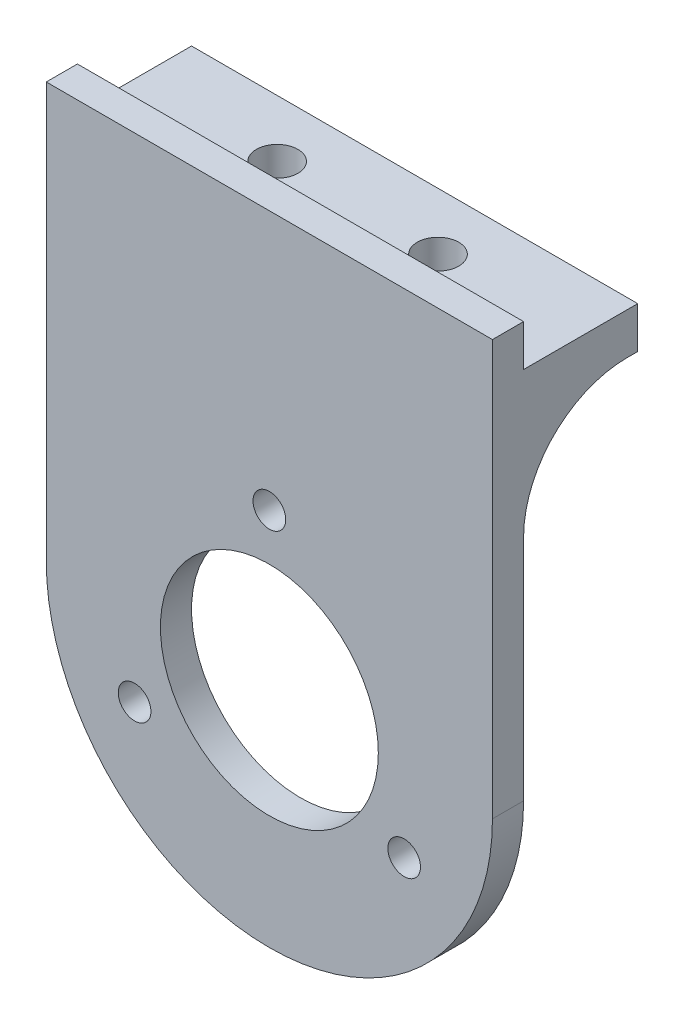
ISO-10303-21;
HEADER;
FILE_DESCRIPTION(('STEP AP214'),'2;1');
FILE_NAME('part.step','',(''),(''),'','','');
FILE_SCHEMA(('AUTOMOTIVE_DESIGN { 1 0 10303 214 1 1 1 1 }'));
ENDSEC;
DATA;
#1=APPLICATION_CONTEXT('core data for automotive mechanical design processes');
#2=APPLICATION_PROTOCOL_DEFINITION('international standard','automotive_design',2000,#1);
#3=PRODUCT_CONTEXT('',#1,'mechanical');
#4=PRODUCT('Part','Part','',(#3));
#5=PRODUCT_RELATED_PRODUCT_CATEGORY('part','',(#4));
#6=PRODUCT_DEFINITION_FORMATION('','',#4);
#7=PRODUCT_DEFINITION_CONTEXT('part definition',#1,'design');
#8=PRODUCT_DEFINITION('design','',#6,#7);
#9=PRODUCT_DEFINITION_SHAPE('','',#8);
#10=(LENGTH_UNIT() NAMED_UNIT(*) SI_UNIT(.MILLI.,.METRE.));
#11=(NAMED_UNIT(*) PLANE_ANGLE_UNIT() SI_UNIT($,.RADIAN.));
#12=(NAMED_UNIT(*) SI_UNIT($,.STERADIAN.) SOLID_ANGLE_UNIT());
#13=UNCERTAINTY_MEASURE_WITH_UNIT(LENGTH_MEASURE(1.E-05),#10,'distance_accuracy_value','');
#14=(GEOMETRIC_REPRESENTATION_CONTEXT(3) GLOBAL_UNCERTAINTY_ASSIGNED_CONTEXT((#13)) GLOBAL_UNIT_ASSIGNED_CONTEXT((#10,
#11,#12)) REPRESENTATION_CONTEXT('',''));
#15=CARTESIAN_POINT('',(0.,0.,0.));
#16=DIRECTION('',(0.,0.,1.));
#17=DIRECTION('',(1.,0.,0.));
#18=AXIS2_PLACEMENT_3D('',#15,#16,#17);
#19=CARTESIAN_POINT('',(-21.51,29.,78.7));
#20=DIRECTION('',(0.,1.,0.));
#21=DIRECTION('',(0.,0.,1.));
#22=AXIS2_PLACEMENT_3D('',#19,#20,#21);
#23=PLANE('',#22);
#24=CARTESIAN_POINT('',(-7.75,29.,84.2));
#25=DIRECTION('',(0.,1.,0.));
#26=DIRECTION('',(0.,0.,1.));
#27=AXIS2_PLACEMENT_3D('',#24,#25,#26);
#28=CIRCLE('',#27,2.);
#29=CARTESIAN_POINT('',(-7.75,29.,86.2));
#30=VERTEX_POINT('',#29);
#31=EDGE_CURVE('E44',#30,#30,#28,.F.);
#32=ORIENTED_EDGE('',*,*,#31,.T.);
#33=EDGE_LOOP('',(#32));
#34=FACE_BOUND('',#33,.T.);
#35=CARTESIAN_POINT('',(7.75,29.,84.2));
#36=DIRECTION('',(0.,1.,0.));
#37=DIRECTION('',(0.,0.,1.));
#38=AXIS2_PLACEMENT_3D('',#35,#36,#37);
#39=CIRCLE('',#38,2.);
#40=CARTESIAN_POINT('',(7.75,29.,86.2));
#41=VERTEX_POINT('',#40);
#42=EDGE_CURVE('E11',#41,#41,#39,.F.);
#43=ORIENTED_EDGE('',*,*,#42,.T.);
#44=EDGE_LOOP('',(#43));
#45=FACE_BOUND('',#44,.T.);
#46=DIRECTION('',(0.,0.,-1.));
#47=VECTOR('',#46,1.);
#48=CARTESIAN_POINT('',(-21.5,29.,0.));
#49=LINE('',#48,#47);
#50=CARTESIAN_POINT('',(-21.5,29.,89.7));
#51=VERTEX_POINT('',#50);
#52=CARTESIAN_POINT('',(-21.5,29.,78.7));
#53=VERTEX_POINT('',#52);
#54=EDGE_CURVE('E110',#51,#53,#49,.T.);
#55=ORIENTED_EDGE('',*,*,#54,.F.);
#56=DIRECTION('',(1.,0.,0.));
#57=VECTOR('',#56,1.);
#58=CARTESIAN_POINT('',(-21.51,29.,89.7));
#59=LINE('',#58,#57);
#60=CARTESIAN_POINT('',(21.5,29.,89.7));
#61=VERTEX_POINT('',#60);
#62=EDGE_CURVE('E59',#51,#61,#59,.T.);
#63=ORIENTED_EDGE('',*,*,#62,.T.);
#64=DIRECTION('',(0.,0.,1.));
#65=VECTOR('',#64,1.);
#66=CARTESIAN_POINT('',(21.5,29.,78.7));
#67=LINE('',#66,#65);
#68=CARTESIAN_POINT('',(21.5,29.,78.7));
#69=VERTEX_POINT('',#68);
#70=EDGE_CURVE('E112',#69,#61,#67,.T.);
#71=ORIENTED_EDGE('',*,*,#70,.F.);
#72=DIRECTION('',(1.,0.,0.));
#73=VECTOR('',#72,1.);
#74=CARTESIAN_POINT('',(-21.5,29.,78.7));
#75=LINE('',#74,#73);
#76=EDGE_CURVE('E108',#53,#69,#75,.T.);
#77=ORIENTED_EDGE('',*,*,#76,.F.);
#78=EDGE_LOOP('',(#55,#63,#71,#77));
#79=FACE_BOUND('',#78,.T.);
#80=ADVANCED_FACE('F36',(#34,#45,#79),#23,.T.);
#81=CARTESIAN_POINT('',(-21.51,29.,89.7));
#82=DIRECTION('',(0.,0.,-1.));
#83=DIRECTION('',(-1.,0.,0.));
#84=AXIS2_PLACEMENT_3D('',#81,#82,#83);
#85=PLANE('',#84);
#86=DIRECTION('',(0.,-1.,0.));
#87=VECTOR('',#86,1.);
#88=CARTESIAN_POINT('',(-21.5,0.,89.7));
#89=LINE('',#88,#87);
#90=CARTESIAN_POINT('',(-21.5,33.,89.7));
#91=VERTEX_POINT('',#90);
#92=EDGE_CURVE('E39',#91,#51,#89,.T.);
#93=ORIENTED_EDGE('',*,*,#92,.F.);
#94=DIRECTION('',(1.,0.,0.));
#95=VECTOR('',#94,1.);
#96=CARTESIAN_POINT('',(-21.51,33.,89.7));
#97=LINE('',#96,#95);
#98=CARTESIAN_POINT('',(21.5,33.,89.7));
#99=VERTEX_POINT('',#98);
#100=EDGE_CURVE('E122',#91,#99,#97,.T.);
#101=ORIENTED_EDGE('',*,*,#100,.T.);
#102=DIRECTION('',(0.,1.,0.));
#103=VECTOR('',#102,1.);
#104=CARTESIAN_POINT('',(21.5,33.,89.7));
#105=LINE('',#104,#103);
#106=EDGE_CURVE('E190',#61,#99,#105,.T.);
#107=ORIENTED_EDGE('',*,*,#106,.F.);
#108=ORIENTED_EDGE('',*,*,#62,.F.);
#109=EDGE_LOOP('',(#93,#101,#107,#108));
#110=FACE_BOUND('',#109,.T.);
#111=ADVANCED_FACE('F244',(#110),#85,.T.);
#112=CARTESIAN_POINT('',(-12.9903810567659,-14.5,92.7));
#113=DIRECTION('',(0.,0.,-1.));
#114=DIRECTION('',(-1.,0.,0.));
#115=AXIS2_PLACEMENT_3D('',#112,#113,#114);
#116=CYLINDRICAL_SURFACE('',#115,1.575);
#117=CARTESIAN_POINT('',(-12.9903810567659,-14.5,92.7));
#118=DIRECTION('',(0.,0.,1.));
#119=DIRECTION('',(1.,0.,0.));
#120=AXIS2_PLACEMENT_3D('',#117,#118,#119);
#121=CIRCLE('',#120,1.575);
#122=CARTESIAN_POINT('',(-11.4153810567659,-14.5,92.7));
#123=VERTEX_POINT('',#122);
#124=EDGE_CURVE('E161',#123,#123,#121,.T.);
#125=ORIENTED_EDGE('',*,*,#124,.T.);
#126=EDGE_LOOP('',(#125));
#127=FACE_BOUND('',#126,.T.);
#128=CARTESIAN_POINT('',(-12.9903810567659,-14.5,89.7));
#129=DIRECTION('',(0.,0.,1.));
#130=DIRECTION('',(1.,0.,0.));
#131=AXIS2_PLACEMENT_3D('',#128,#129,#130);
#132=CIRCLE('',#131,1.575);
#133=CARTESIAN_POINT('',(-11.4153810567659,-14.5,89.7));
#134=VERTEX_POINT('',#133);
#135=EDGE_CURVE('E145',#134,#134,#132,.T.);
#136=ORIENTED_EDGE('',*,*,#135,.F.);
#137=EDGE_LOOP('',(#136));
#138=FACE_BOUND('',#137,.T.);
#139=ADVANCED_FACE('F240',(#127,#138),#116,.F.);
#140=CARTESIAN_POINT('',(12.9903810567669,-14.4999999999994,92.7));
#141=DIRECTION('',(0.,0.,-1.));
#142=DIRECTION('',(-1.,0.,0.));
#143=AXIS2_PLACEMENT_3D('',#140,#141,#142);
#144=CYLINDRICAL_SURFACE('',#143,1.575);
#145=CARTESIAN_POINT('',(12.9903810567669,-14.4999999999994,92.7));
#146=DIRECTION('',(0.,0.,1.));
#147=DIRECTION('',(1.,0.,0.));
#148=AXIS2_PLACEMENT_3D('',#145,#146,#147);
#149=CIRCLE('',#148,1.575);
#150=CARTESIAN_POINT('',(14.5653810567669,-14.4999999999994,92.7));
#151=VERTEX_POINT('',#150);
#152=EDGE_CURVE('E158',#151,#151,#149,.T.);
#153=ORIENTED_EDGE('',*,*,#152,.T.);
#154=EDGE_LOOP('',(#153));
#155=FACE_BOUND('',#154,.T.);
#156=CARTESIAN_POINT('',(12.9903810567669,-14.4999999999994,89.7));
#157=DIRECTION('',(0.,0.,1.));
#158=DIRECTION('',(1.,0.,0.));
#159=AXIS2_PLACEMENT_3D('',#156,#157,#158);
#160=CIRCLE('',#159,1.575);
#161=CARTESIAN_POINT('',(14.5653810567669,-14.4999999999994,89.7));
#162=VERTEX_POINT('',#161);
#163=EDGE_CURVE('E178',#162,#162,#160,.T.);
#164=ORIENTED_EDGE('',*,*,#163,.F.);
#165=EDGE_LOOP('',(#164));
#166=FACE_BOUND('',#165,.T.);
#167=ADVANCED_FACE('F243',(#155,#166),#144,.F.);
#168=CARTESIAN_POINT('',(0.,8.,92.7));
#169=DIRECTION('',(0.,0.,-1.));
#170=DIRECTION('',(-1.,0.,0.));
#171=AXIS2_PLACEMENT_3D('',#168,#169,#170);
#172=CYLINDRICAL_SURFACE('',#171,1.575);
#173=CARTESIAN_POINT('',(0.,8.,92.7));
#174=DIRECTION('',(0.,0.,1.));
#175=DIRECTION('',(1.,0.,0.));
#176=AXIS2_PLACEMENT_3D('',#173,#174,#175);
#177=CIRCLE('',#176,1.575);
#178=CARTESIAN_POINT('',(1.575,8.,92.7));
#179=VERTEX_POINT('',#178);
#180=EDGE_CURVE('E155',#179,#179,#177,.T.);
#181=ORIENTED_EDGE('',*,*,#180,.T.);
#182=EDGE_LOOP('',(#181));
#183=FACE_BOUND('',#182,.T.);
#184=CARTESIAN_POINT('',(0.,8.,89.7));
#185=DIRECTION('',(0.,0.,1.));
#186=DIRECTION('',(1.,0.,0.));
#187=AXIS2_PLACEMENT_3D('',#184,#185,#186);
#188=CIRCLE('',#187,1.575);
#189=CARTESIAN_POINT('',(1.575,8.,89.7));
#190=VERTEX_POINT('',#189);
#191=EDGE_CURVE('E175',#190,#190,#188,.T.);
#192=ORIENTED_EDGE('',*,*,#191,.F.);
#193=EDGE_LOOP('',(#192));
#194=FACE_BOUND('',#193,.T.);
#195=ADVANCED_FACE('F248',(#183,#194),#172,.F.);
#196=CARTESIAN_POINT('',(0.,-7.,92.7));
#197=DIRECTION('',(0.,0.,-1.));
#198=DIRECTION('',(-1.,0.,0.));
#199=AXIS2_PLACEMENT_3D('',#196,#197,#198);
#200=CYLINDRICAL_SURFACE('',#199,10.5);
#201=CARTESIAN_POINT('',(0.,-7.,92.7));
#202=DIRECTION('',(0.,0.,1.));
#203=DIRECTION('',(1.,0.,0.));
#204=AXIS2_PLACEMENT_3D('',#201,#202,#203);
#205=CIRCLE('',#204,10.5);
#206=CARTESIAN_POINT('',(10.5,-7.,92.7));
#207=VERTEX_POINT('',#206);
#208=EDGE_CURVE('E152',#207,#207,#205,.T.);
#209=ORIENTED_EDGE('',*,*,#208,.T.);
#210=EDGE_LOOP('',(#209));
#211=FACE_BOUND('',#210,.T.);
#212=CARTESIAN_POINT('',(0.,-7.,89.7));
#213=DIRECTION('',(0.,0.,1.));
#214=DIRECTION('',(1.,0.,0.));
#215=AXIS2_PLACEMENT_3D('',#212,#213,#214);
#216=CIRCLE('',#215,10.5);
#217=CARTESIAN_POINT('',(10.5,-7.,89.7));
#218=VERTEX_POINT('',#217);
#219=EDGE_CURVE('E172',#218,#218,#216,.T.);
#220=ORIENTED_EDGE('',*,*,#219,.F.);
#221=EDGE_LOOP('',(#220));
#222=FACE_BOUND('',#221,.T.);
#223=ADVANCED_FACE('F252',(#211,#222),#200,.F.);
#224=CARTESIAN_POINT('',(0.,-7.,92.7));
#225=DIRECTION('',(0.,0.,-1.));
#226=DIRECTION('',(-1.,0.,0.));
#227=AXIS2_PLACEMENT_3D('',#224,#225,#226);
#228=CYLINDRICAL_SURFACE('',#227,21.5);
#229=CARTESIAN_POINT('',(0.,-7.,89.7));
#230=DIRECTION('',(0.,0.,1.));
#231=DIRECTION('',(1.,0.,0.));
#232=AXIS2_PLACEMENT_3D('',#229,#230,#231);
#233=CIRCLE('',#232,21.5);
#234=CARTESIAN_POINT('',(-21.5,-7.,89.7));
#235=VERTEX_POINT('',#234);
#236=CARTESIAN_POINT('',(21.5,-7.,89.7));
#237=VERTEX_POINT('',#236);
#238=EDGE_CURVE('E167',#235,#237,#233,.T.);
#239=ORIENTED_EDGE('',*,*,#238,.T.);
#240=DIRECTION('',(0.,0.,-1.));
#241=VECTOR('',#240,1.);
#242=CARTESIAN_POINT('',(21.5,-7.,92.7));
#243=LINE('',#242,#241);
#244=CARTESIAN_POINT('',(21.5,-7.,92.7));
#245=VERTEX_POINT('',#244);
#246=EDGE_CURVE('E185',#245,#237,#243,.T.);
#247=ORIENTED_EDGE('',*,*,#246,.F.);
#248=CARTESIAN_POINT('',(0.,-7.,92.7));
#249=DIRECTION('',(0.,0.,1.));
#250=DIRECTION('',(1.,0.,0.));
#251=AXIS2_PLACEMENT_3D('',#248,#249,#250);
#252=CIRCLE('',#251,21.5);
#253=CARTESIAN_POINT('',(-21.5,-7.,92.7));
#254=VERTEX_POINT('',#253);
#255=EDGE_CURVE('E144',#254,#245,#252,.T.);
#256=ORIENTED_EDGE('',*,*,#255,.F.);
#257=DIRECTION('',(0.,0.,-1.));
#258=VECTOR('',#257,1.);
#259=CARTESIAN_POINT('',(-21.5,-7.,92.7));
#260=LINE('',#259,#258);
#261=EDGE_CURVE('E188',#254,#235,#260,.T.);
#262=ORIENTED_EDGE('',*,*,#261,.T.);
#263=EDGE_LOOP('',(#239,#247,#256,#262));
#264=FACE_BOUND('',#263,.T.);
#265=ADVANCED_FACE('F235',(#264),#228,.T.);
#266=CARTESIAN_POINT('',(0.,0.,92.7));
#267=DIRECTION('',(0.,0.,1.));
#268=DIRECTION('',(1.,0.,0.));
#269=AXIS2_PLACEMENT_3D('',#266,#267,#268);
#270=PLANE('',#269);
#271=DIRECTION('',(0.,1.,0.));
#272=VECTOR('',#271,1.);
#273=CARTESIAN_POINT('',(-21.5,0.,92.7));
#274=LINE('',#273,#272);
#275=CARTESIAN_POINT('',(-21.5,33.,92.7));
#276=VERTEX_POINT('',#275);
#277=EDGE_CURVE('E142',#254,#276,#274,.T.);
#278=ORIENTED_EDGE('',*,*,#277,.F.);
#279=ORIENTED_EDGE('',*,*,#255,.T.);
#280=DIRECTION('',(0.,1.,0.));
#281=VECTOR('',#280,1.);
#282=CARTESIAN_POINT('',(21.5,0.,92.7));
#283=LINE('',#282,#281);
#284=CARTESIAN_POINT('',(21.5,33.,92.7));
#285=VERTEX_POINT('',#284);
#286=EDGE_CURVE('E147',#245,#285,#283,.T.);
#287=ORIENTED_EDGE('',*,*,#286,.T.);
#288=DIRECTION('',(-1.,0.,0.));
#289=VECTOR('',#288,1.);
#290=CARTESIAN_POINT('',(0.,33.,92.7));
#291=LINE('',#290,#289);
#292=EDGE_CURVE('E149',#285,#276,#291,.T.);
#293=ORIENTED_EDGE('',*,*,#292,.T.);
#294=EDGE_LOOP('',(#278,#279,#287,#293));
#295=FACE_BOUND('',#294,.T.);
#296=ORIENTED_EDGE('',*,*,#208,.F.);
#297=EDGE_LOOP('',(#296));
#298=FACE_BOUND('',#297,.T.);
#299=ORIENTED_EDGE('',*,*,#180,.F.);
#300=EDGE_LOOP('',(#299));
#301=FACE_BOUND('',#300,.T.);
#302=ORIENTED_EDGE('',*,*,#152,.F.);
#303=EDGE_LOOP('',(#302));
#304=FACE_BOUND('',#303,.T.);
#305=ORIENTED_EDGE('',*,*,#124,.F.);
#306=EDGE_LOOP('',(#305));
#307=FACE_BOUND('',#306,.T.);
#308=ADVANCED_FACE('F231',(#295,#298,#301,#304,#307),#270,.T.);
#309=CARTESIAN_POINT('',(0.,0.,89.7));
#310=DIRECTION('',(0.,0.,1.));
#311=DIRECTION('',(1.,0.,0.));
#312=AXIS2_PLACEMENT_3D('',#309,#310,#311);
#313=PLANE('',#312);
#314=ORIENTED_EDGE('',*,*,#135,.T.);
#315=EDGE_LOOP('',(#314));
#316=FACE_BOUND('',#315,.T.);
#317=ORIENTED_EDGE('',*,*,#163,.T.);
#318=EDGE_LOOP('',(#317));
#319=FACE_BOUND('',#318,.T.);
#320=ORIENTED_EDGE('',*,*,#191,.T.);
#321=EDGE_LOOP('',(#320));
#322=FACE_BOUND('',#321,.T.);
#323=ORIENTED_EDGE('',*,*,#219,.T.);
#324=EDGE_LOOP('',(#323));
#325=FACE_BOUND('',#324,.T.);
#326=DIRECTION('',(0.,1.,0.));
#327=VECTOR('',#326,1.);
#328=CARTESIAN_POINT('',(-21.5,0.,89.7));
#329=LINE('',#328,#327);
#330=CARTESIAN_POINT('',(-21.5,15.,89.7));
#331=VERTEX_POINT('',#330);
#332=EDGE_CURVE('E141',#235,#331,#329,.T.);
#333=ORIENTED_EDGE('',*,*,#332,.T.);
#334=DIRECTION('',(-1.,0.,0.));
#335=VECTOR('',#334,1.);
#336=CARTESIAN_POINT('',(21.5,15.,89.7));
#337=LINE('',#336,#335);
#338=CARTESIAN_POINT('',(21.5,15.,89.7));
#339=VERTEX_POINT('',#338);
#340=EDGE_CURVE('E196',#331,#339,#337,.F.);
#341=ORIENTED_EDGE('',*,*,#340,.T.);
#342=DIRECTION('',(0.,1.,0.));
#343=VECTOR('',#342,1.);
#344=CARTESIAN_POINT('',(21.5,0.,89.7));
#345=LINE('',#344,#343);
#346=EDGE_CURVE('E169',#237,#339,#345,.T.);
#347=ORIENTED_EDGE('',*,*,#346,.F.);
#348=ORIENTED_EDGE('',*,*,#238,.F.);
#349=EDGE_LOOP('',(#333,#341,#347,#348));
#350=FACE_BOUND('',#349,.T.);
#351=ADVANCED_FACE('F234',(#316,#319,#322,#325,#350),#313,.F.);
#352=CARTESIAN_POINT('',(-21.5,0.,0.));
#353=DIRECTION('',(-1.,0.,0.));
#354=DIRECTION('',(0.,1.,0.));
#355=AXIS2_PLACEMENT_3D('',#352,#353,#354);
#356=PLANE('',#355);
#357=ORIENTED_EDGE('',*,*,#92,.T.);
#358=ORIENTED_EDGE('',*,*,#54,.T.);
#359=DIRECTION('',(0.,1.,0.));
#360=VECTOR('',#359,1.);
#361=CARTESIAN_POINT('',(-21.5,29.,78.7));
#362=LINE('',#361,#360);
#363=CARTESIAN_POINT('',(-21.5,25.,78.7));
#364=VERTEX_POINT('',#363);
#365=EDGE_CURVE('E117',#364,#53,#362,.T.);
#366=ORIENTED_EDGE('',*,*,#365,.F.);
#367=DIRECTION('',(0.,0.,1.));
#368=VECTOR('',#367,1.);
#369=CARTESIAN_POINT('',(-21.5,25.,78.7));
#370=LINE('',#369,#368);
#371=CARTESIAN_POINT('',(-21.5,25.,79.7));
#372=VERTEX_POINT('',#371);
#373=EDGE_CURVE('E135',#364,#372,#370,.T.);
#374=ORIENTED_EDGE('',*,*,#373,.T.);
#375=CARTESIAN_POINT('',(-21.5,15.,79.7));
#376=DIRECTION('',(1.,0.,0.));
#377=DIRECTION('',(0.,0.,-1.));
#378=AXIS2_PLACEMENT_3D('',#375,#376,#377);
#379=CIRCLE('',#378,10.);
#380=EDGE_CURVE('E198',#372,#331,#379,.T.);
#381=ORIENTED_EDGE('',*,*,#380,.T.);
#382=ORIENTED_EDGE('',*,*,#332,.F.);
#383=ORIENTED_EDGE('',*,*,#261,.F.);
#384=ORIENTED_EDGE('',*,*,#277,.T.);
#385=DIRECTION('',(0.,0.,-1.));
#386=VECTOR('',#385,1.);
#387=CARTESIAN_POINT('',(-21.5,33.,3.));
#388=LINE('',#387,#386);
#389=EDGE_CURVE('E52',#276,#91,#388,.T.);
#390=ORIENTED_EDGE('',*,*,#389,.T.);
#391=EDGE_LOOP('',(#357,#358,#366,#374,#381,#382,#383,#384,#390));
#392=FACE_BOUND('',#391,.T.);
#393=ADVANCED_FACE('F120',(#392),#356,.T.);
#394=CARTESIAN_POINT('',(-21.5,15.,79.7));
#395=DIRECTION('',(1.,0.,0.));
#396=DIRECTION('',(0.,1.,0.));
#397=AXIS2_PLACEMENT_3D('',#394,#395,#396);
#398=CYLINDRICAL_SURFACE('',#397,10.);
#399=CARTESIAN_POINT('',(7.75,24.6824583655185,82.2));
#400=CARTESIAN_POINT('',(7.64080827561781,24.6824583379124,82.1999986392879));
#401=CARTESIAN_POINT('',(7.53162716349522,24.6801564785405,82.2089661921619));
#402=CARTESIAN_POINT('',(7.31639131961118,24.670869640042,82.2445264782188));
#403=CARTESIAN_POINT('',(7.21033611969953,24.6638853659329,82.2711165580224));
#404=CARTESIAN_POINT('',(7.00436601507315,24.6450185393979,82.3410068075311));
#405=CARTESIAN_POINT('',(6.90445021938456,24.6331366996639,82.3843045458857));
#406=CARTESIAN_POINT('',(6.71352374947328,24.604185664915,82.4861093568353));
#407=CARTESIAN_POINT('',(6.62251303693105,24.587116492223,82.5446163639791));
#408=CARTESIAN_POINT('',(6.45137659394508,24.5474205427028,82.6751338382811));
#409=CARTESIAN_POINT('',(6.37130900433635,24.5247657474968,82.7472119355657));
#410=CARTESIAN_POINT('',(6.22455401549788,24.473798063583,82.9021538828138));
#411=CARTESIAN_POINT('',(6.15786724515635,24.4454849090613,82.9850182394214));
#412=CARTESIAN_POINT('',(6.03767576045072,24.3824638324428,83.160969524797));
#413=CARTESIAN_POINT('',(5.98455023009973,24.3476113503979,83.2542631303165));
#414=CARTESIAN_POINT('',(5.89444682631101,24.2723473117101,83.4462258551541));
#415=CARTESIAN_POINT('',(5.85747274991146,24.2319344508133,83.5448962323697));
#416=CARTESIAN_POINT('',(5.79797696122963,24.143536194802,83.7508064072884));
#417=CARTESIAN_POINT('',(5.7764650861822,24.0952405634313,83.8582034726702));
#418=CARTESIAN_POINT('',(5.75111687784851,23.9940059012189,84.0728669383027));
#419=CARTESIAN_POINT('',(5.74728666733834,23.9410652683796,84.1801332804343));
#420=CARTESIAN_POINT('',(5.7568718441407,23.8262973600434,84.4025111616102));
#421=CARTESIAN_POINT('',(5.7720152907918,23.7641077354228,84.5173604607913));
#422=CARTESIAN_POINT('',(5.82127008042218,23.637144071847,84.7414648033323));
#423=CARTESIAN_POINT('',(5.85539518239921,23.5723681898746,84.8507157258573));
#424=CARTESIAN_POINT('',(5.9458936251896,23.4354428402928,85.0723314432006));
#425=CARTESIAN_POINT('',(6.00418816684249,23.3632178544128,85.1838684982631));
#426=CARTESIAN_POINT('',(6.14136947005275,23.2208595730549,85.3950570270251));
#427=CARTESIAN_POINT('',(6.22025491948667,23.1507261446129,85.4947092574772));
#428=CARTESIAN_POINT('',(6.3833210142644,23.0273503766566,85.6641247863547));
#429=CARTESIAN_POINT('',(6.46452246328007,22.9732220726737,85.7361105916627));
#430=CARTESIAN_POINT('',(6.64035161922666,22.8719958814487,85.867539191983));
#431=CARTESIAN_POINT('',(6.73495918312333,22.824887660348,85.9270004780507));
#432=CARTESIAN_POINT('',(6.91623190860759,22.7497281173111,86.0201709908969));
#433=CARTESIAN_POINT('',(7.00066459664833,22.7197495537924,86.0566544919211));
#434=CARTESIAN_POINT('',(7.17616944759799,22.6686905723483,86.1181609850448));
#435=CARTESIAN_POINT('',(7.26723624035701,22.6476030491707,86.1431931298314));
#436=CARTESIAN_POINT('',(7.45448393666325,22.6161362208922,86.180361480923));
#437=CARTESIAN_POINT('',(7.55069527893369,22.6058303487423,86.1924092683625));
#438=CARTESIAN_POINT('',(7.74437408729608,22.5973453353445,86.2023377130634));
#439=CARTESIAN_POINT('',(7.84184102730449,22.5991612701792,86.2002241227212));
#440=CARTESIAN_POINT('',(8.02397657506245,22.6138338208376,86.183026124615));
#441=CARTESIAN_POINT('',(8.10888785360279,22.6254731438374,86.1693715848897));
#442=CARTESIAN_POINT('',(8.27474349572159,22.6571832634856,86.131807165221));
#443=CARTESIAN_POINT('',(8.35568705611905,22.6772557594458,86.1078952183563));
#444=CARTESIAN_POINT('',(8.51638643839606,22.7256936337148,86.0494224000154));
#445=CARTESIAN_POINT('',(8.59583451733855,22.7544529278069,86.0143501128629));
#446=CARTESIAN_POINT('',(8.74767482369582,22.8179948424646,85.9355052827159));
#447=CARTESIAN_POINT('',(8.82006147848301,22.8527821609858,85.8917259499024));
#448=CARTESIAN_POINT('',(8.98914596715215,22.9439688790645,85.7746268093876));
#449=CARTESIAN_POINT('',(9.08153237200499,23.0029049061701,85.6970276148198));
#450=CARTESIAN_POINT('',(9.24940074749502,23.126188114236,85.5288913111404));
#451=CARTESIAN_POINT('',(9.32485721038263,23.1905432620248,85.4383350117367));
#452=CARTESIAN_POINT('',(9.45895799796808,23.3222343672173,85.2456437287843));
#453=CARTESIAN_POINT('',(9.51741982479098,23.3895943187938,85.143398390441));
#454=CARTESIAN_POINT('',(9.61562684314872,23.5241291078272,84.9302120509508));
#455=CARTESIAN_POINT('',(9.65537456665389,23.591303969103,84.8192722285157));
#456=CARTESIAN_POINT('',(9.71796711075016,23.7299712565588,84.57940716432));
#457=CARTESIAN_POINT('',(9.73873281019318,23.8012268562671,84.4497913293785));
#458=CARTESIAN_POINT('',(9.75430043423304,23.9384663188416,84.1861864780642));
#459=CARTESIAN_POINT('',(9.74910519119838,24.0044507559995,84.0521979403428));
#460=CARTESIAN_POINT('',(9.7122079246021,24.1251573224114,83.7927644581223));
#461=CARTESIAN_POINT('',(9.68214105625444,24.1803207952554,83.6672966126502));
#462=CARTESIAN_POINT('',(9.59691837583752,24.2825937616043,83.4217076230063));
#463=CARTESIAN_POINT('',(9.54178558025543,24.3297105893647,83.301581684539));
#464=CARTESIAN_POINT('',(9.41479299693271,24.4101513683073,83.085388511726));
#465=CARTESIAN_POINT('',(9.34554857772846,24.4444345387617,82.9881388393988));
#466=CARTESIAN_POINT('',(9.1894444664098,24.5057852150797,82.8063252758892));
#467=CARTESIAN_POINT('',(9.1025938905143,24.5328564384683,82.72175485883));
#468=CARTESIAN_POINT('',(8.92144707669062,24.5780503291147,82.5751323154196));
#469=CARTESIAN_POINT('',(8.82830324634723,24.5967158220253,82.5118195931057));
#470=CARTESIAN_POINT('',(8.63195719362779,24.6283719759814,82.4014370827434));
#471=CARTESIAN_POINT('',(8.52875578411098,24.6413630951685,82.3543659834317));
#472=CARTESIAN_POINT('',(8.31478400384784,24.662059336943,82.2780218675416));
#473=CARTESIAN_POINT('',(8.20397314528283,24.6697333129191,82.2488538347541));
#474=CARTESIAN_POINT('',(7.9787708155106,24.6799326686741,82.209844263029));
#475=CARTESIAN_POINT('',(7.86437958544353,24.6824583944363,82.2000014253616));
#476=CARTESIAN_POINT('',(7.75,24.6824583655185,82.2));
#477=B_SPLINE_CURVE_WITH_KNOTS('',3,(#399,#400,#401,#402,#403,#404,#405,#406,#407,#408,#409,
#410,#411,#412,#413,#414,#415,#416,#417,#418,#419,#420,#421,#422,#423,#424,#425,#426,#427,#428,
#429,#430,#431,#432,#433,#434,#435,#436,#437,#438,#439,#440,#441,#442,#443,#444,#445,#446,#447,
#448,#449,#450,#451,#452,#453,#454,#455,#456,#457,#458,#459,#460,#461,#462,#463,#464,#465,#466,
#467,#468,#469,#470,#471,#472,#473,#474,#475,#476),.UNSPECIFIED.,.T.,.F.,(4,2,2,2,2,2,2,2,2,2,2,
2,2,2,2,2,2,2,2,2,2,2,2,2,2,2,2,2,2,2,2,2,2,2,2,2,2,2,4),(0.,0.327168055141757,
0.654286860605836,0.981358080665049,1.30842789323914,1.63717296572978,1.96593348536856,
2.30307102426843,2.64028777808532,2.99790854802382,3.35565314497705,3.74848067415609,
4.14159331913041,4.57498153800991,5.00834214664126,5.3707835583126,5.73268605570641,
6.02176614968986,6.3106147861664,6.60141818730625,6.89210347035125,7.1513002110935,
7.41054920589493,7.68399416897296,7.95765320849915,8.3583363729147,8.75961923812206,
9.16506431605527,9.57045452253133,10.0162426323814,10.4619821073012,10.880549374153,
11.2987330704675,11.6693582801149,12.0397920732,12.3805753542482,12.7213311158037,
13.0640664453139,13.4067787408584),.UNSPECIFIED.);
#478=CARTESIAN_POINT('',(7.75,24.6824583655185,82.2));
#479=VERTEX_POINT('',#478);
#480=EDGE_CURVE('E127',#479,#479,#477,.T.);
#481=ORIENTED_EDGE('',*,*,#480,.T.);
#482=EDGE_LOOP('',(#481));
#483=FACE_BOUND('',#482,.T.);
#484=CARTESIAN_POINT('',(-7.75,24.6824583655185,82.2));
#485=CARTESIAN_POINT('',(-7.85919172438219,24.6824583379124,82.1999986392879));
#486=CARTESIAN_POINT('',(-7.96837283650478,24.6801564785405,82.2089661921619));
#487=CARTESIAN_POINT('',(-8.18360868038882,24.670869640042,82.2445264782188));
#488=CARTESIAN_POINT('',(-8.28966388030046,24.6638853659329,82.2711165580224));
#489=CARTESIAN_POINT('',(-8.49563398492685,24.6450185393979,82.3410068075311));
#490=CARTESIAN_POINT('',(-8.59554978061544,24.6331366996639,82.3843045458857));
#491=CARTESIAN_POINT('',(-8.78647625052672,24.604185664915,82.4861093568353));
#492=CARTESIAN_POINT('',(-8.87748696306895,24.587116492223,82.5446163639791));
#493=CARTESIAN_POINT('',(-9.04862340605492,24.5474205427028,82.6751338382811));
#494=CARTESIAN_POINT('',(-9.12869099566365,24.5247657474968,82.7472119355657));
#495=CARTESIAN_POINT('',(-9.27544598450212,24.473798063583,82.9021538828138));
#496=CARTESIAN_POINT('',(-9.34213275484365,24.4454849090613,82.9850182394214));
#497=CARTESIAN_POINT('',(-9.46232423954928,24.3824638324428,83.160969524797));
#498=CARTESIAN_POINT('',(-9.51544976990027,24.3476113503979,83.2542631303165));
#499=CARTESIAN_POINT('',(-9.60555317368899,24.2723473117101,83.4462258551541));
#500=CARTESIAN_POINT('',(-9.64252725008854,24.2319344508133,83.5448962323697));
#501=CARTESIAN_POINT('',(-9.70202303877037,24.143536194802,83.7508064072884));
#502=CARTESIAN_POINT('',(-9.7235349138178,24.0952405634313,83.8582034726702));
#503=CARTESIAN_POINT('',(-9.74888312215149,23.9940059012189,84.0728669383026));
#504=CARTESIAN_POINT('',(-9.75271333266166,23.9410652683796,84.1801332804343));
#505=CARTESIAN_POINT('',(-9.7431281558593,23.8262973600434,84.4025111616102));
#506=CARTESIAN_POINT('',(-9.7279847092082,23.7641077354228,84.5173604607913));
#507=CARTESIAN_POINT('',(-9.67872991957783,23.6371440718471,84.7414648033323));
#508=CARTESIAN_POINT('',(-9.64460481760079,23.5723681898746,84.8507157258572));
#509=CARTESIAN_POINT('',(-9.55410637481041,23.4354428402928,85.0723314432006));
#510=CARTESIAN_POINT('',(-9.49581183315751,23.3632178544128,85.1838684982631));
#511=CARTESIAN_POINT('',(-9.35863052994726,23.2208595730549,85.3950570270251));
#512=CARTESIAN_POINT('',(-9.27974508051333,23.1507261446129,85.4947092574772));
#513=CARTESIAN_POINT('',(-9.1166789857356,23.0273503766566,85.6641247863547));
#514=CARTESIAN_POINT('',(-9.03547753671993,22.9732220726737,85.7361105916627));
#515=CARTESIAN_POINT('',(-8.85964838077334,22.8719958814487,85.867539191983));
#516=CARTESIAN_POINT('',(-8.76504081687667,22.824887660348,85.9270004780507));
#517=CARTESIAN_POINT('',(-8.58376809139241,22.7497281173111,86.0201709908969));
#518=CARTESIAN_POINT('',(-8.49933540335167,22.7197495537924,86.0566544919211));
#519=CARTESIAN_POINT('',(-8.32383055240201,22.6686905723483,86.1181609850448));
#520=CARTESIAN_POINT('',(-8.23276375964299,22.6476030491707,86.1431931298314));
#521=CARTESIAN_POINT('',(-8.04551606333674,22.6161362208922,86.180361480923));
#522=CARTESIAN_POINT('',(-7.94930472106631,22.6058303487423,86.1924092683625));
#523=CARTESIAN_POINT('',(-7.75562591270391,22.5973453353445,86.2023377130634));
#524=CARTESIAN_POINT('',(-7.6581589726955,22.5991612701792,86.2002241227212));
#525=CARTESIAN_POINT('',(-7.47602342493754,22.6138338208376,86.183026124615));
#526=CARTESIAN_POINT('',(-7.39111214639721,22.6254731438374,86.1693715848897));
#527=CARTESIAN_POINT('',(-7.2252565042784,22.6571832634856,86.131807165221));
#528=CARTESIAN_POINT('',(-7.14431294388094,22.6772557594458,86.1078952183563));
#529=CARTESIAN_POINT('',(-6.98361356160394,22.7256936337148,86.0494224000154));
#530=CARTESIAN_POINT('',(-6.90416548266145,22.7544529278069,86.0143501128629));
#531=CARTESIAN_POINT('',(-6.75232517630418,22.8179948424646,85.9355052827159));
#532=CARTESIAN_POINT('',(-6.67993852151699,22.8527821609858,85.8917259499024));
#533=CARTESIAN_POINT('',(-6.51085403284785,22.9439688790645,85.7746268093876));
#534=CARTESIAN_POINT('',(-6.41846762799501,23.0029049061701,85.6970276148198));
#535=CARTESIAN_POINT('',(-6.25059925250498,23.126188114236,85.5288913111404));
#536=CARTESIAN_POINT('',(-6.17514278961737,23.1905432620248,85.4383350117367));
#537=CARTESIAN_POINT('',(-6.04104200203192,23.3222343672173,85.2456437287843));
#538=CARTESIAN_POINT('',(-5.98258017520901,23.3895943187938,85.143398390441));
#539=CARTESIAN_POINT('',(-5.88437315685127,23.5241291078272,84.9302120509508));
#540=CARTESIAN_POINT('',(-5.84462543334611,23.591303969103,84.8192722285157));
#541=CARTESIAN_POINT('',(-5.78203288924984,23.7299712565588,84.57940716432));
#542=CARTESIAN_POINT('',(-5.76126718980682,23.8012268562671,84.4497913293785));
#543=CARTESIAN_POINT('',(-5.74569956576696,23.9384663188416,84.1861864780642));
#544=CARTESIAN_POINT('',(-5.75089480880162,24.0044507559995,84.0521979403428));
#545=CARTESIAN_POINT('',(-5.7877920753979,24.1251573224114,83.7927644581223));
#546=CARTESIAN_POINT('',(-5.81785894374557,24.1803207952554,83.6672966126502));
#547=CARTESIAN_POINT('',(-5.90308162416248,24.2825937616043,83.4217076230063));
#548=CARTESIAN_POINT('',(-5.95821441974457,24.3297105893647,83.301581684539));
#549=CARTESIAN_POINT('',(-6.0852070030673,24.4101513683074,83.085388511726));
#550=CARTESIAN_POINT('',(-6.15445142227154,24.4444345387617,82.9881388393988));
#551=CARTESIAN_POINT('',(-6.31055553359021,24.5057852150797,82.8063252758892));
#552=CARTESIAN_POINT('',(-6.39740610948571,24.5328564384683,82.72175485883));
#553=CARTESIAN_POINT('',(-6.57855292330939,24.5780503291147,82.5751323154196));
#554=CARTESIAN_POINT('',(-6.67169675365278,24.5967158220253,82.5118195931057));
#555=CARTESIAN_POINT('',(-6.86804280637222,24.6283719759814,82.4014370827434));
#556=CARTESIAN_POINT('',(-6.97124421588903,24.6413630951685,82.3543659834317));
#557=CARTESIAN_POINT('',(-7.18521599615216,24.662059336943,82.2780218675416));
#558=CARTESIAN_POINT('',(-7.29602685471717,24.6697333129191,82.2488538347541));
#559=CARTESIAN_POINT('',(-7.5212291844894,24.6799326686741,82.209844263029));
#560=CARTESIAN_POINT('',(-7.63562041455647,24.6824583944363,82.2000014253616));
#561=CARTESIAN_POINT('',(-7.75,24.6824583655185,82.2));
#562=B_SPLINE_CURVE_WITH_KNOTS('',3,(#484,#485,#486,#487,#488,#489,#490,#491,#492,#493,#494,
#495,#496,#497,#498,#499,#500,#501,#502,#503,#504,#505,#506,#507,#508,#509,#510,#511,#512,#513,
#514,#515,#516,#517,#518,#519,#520,#521,#522,#523,#524,#525,#526,#527,#528,#529,#530,#531,#532,
#533,#534,#535,#536,#537,#538,#539,#540,#541,#542,#543,#544,#545,#546,#547,#548,#549,#550,#551,
#552,#553,#554,#555,#556,#557,#558,#559,#560,#561),.UNSPECIFIED.,.T.,.F.,(4,2,2,2,2,2,2,2,2,2,2,
2,2,2,2,2,2,2,2,2,2,2,2,2,2,2,2,2,2,2,2,2,2,2,2,2,2,2,4),(0.,0.327168055141756,
0.654286860605835,0.981358080665048,1.30842789323914,1.63717296572978,1.96593348536855,
2.30307102426843,2.64028777808532,2.9979085480238,3.35565314497705,3.74848067415609,
4.14159331913039,4.5749815380099,5.00834214664126,5.3707835583126,5.73268605570641,
6.02176614968986,6.3106147861664,6.60141818730626,6.89210347035126,7.1513002110935,
7.41054920589493,7.68399416897295,7.95765320849915,8.3583363729147,8.75961923812206,
9.16506431605527,9.57045452253134,10.0162426323814,10.4619821073012,10.880549374153,
11.2987330704675,11.6693582801149,12.0397920732,12.3805753542482,12.7213311158037,
13.0640664453139,13.4067787408583),.UNSPECIFIED.);
#563=CARTESIAN_POINT('',(-7.75,24.6824583655185,82.2));
#564=VERTEX_POINT('',#563);
#565=EDGE_CURVE('E130',#564,#564,#562,.T.);
#566=ORIENTED_EDGE('',*,*,#565,.T.);
#567=EDGE_LOOP('',(#566));
#568=FACE_BOUND('',#567,.T.);
#569=CARTESIAN_POINT('',(21.5,15.,79.7));
#570=DIRECTION('',(-1.,0.,0.));
#571=DIRECTION('',(0.,-1.,0.));
#572=AXIS2_PLACEMENT_3D('',#569,#570,#571);
#573=CIRCLE('',#572,10.);
#574=CARTESIAN_POINT('',(21.5,25.,79.7));
#575=VERTEX_POINT('',#574);
#576=EDGE_CURVE('E200',#339,#575,#573,.T.);
#577=ORIENTED_EDGE('',*,*,#576,.F.);
#578=ORIENTED_EDGE('',*,*,#340,.F.);
#579=ORIENTED_EDGE('',*,*,#380,.F.);
#580=DIRECTION('',(-1.,0.,0.));
#581=VECTOR('',#580,1.);
#582=CARTESIAN_POINT('',(-21.5,25.,79.7));
#583=LINE('',#582,#581);
#584=EDGE_CURVE('E193',#575,#372,#583,.T.);
#585=ORIENTED_EDGE('',*,*,#584,.F.);
#586=EDGE_LOOP('',(#577,#578,#579,#585));
#587=FACE_BOUND('',#586,.T.);
#588=ADVANCED_FACE('F212',(#483,#568,#587),#398,.F.);
#589=CARTESIAN_POINT('',(7.75,33.,84.2));
#590=DIRECTION('',(0.,-1.,0.));
#591=DIRECTION('',(0.,0.,-1.));
#592=AXIS2_PLACEMENT_3D('',#589,#590,#591);
#593=CYLINDRICAL_SURFACE('',#592,2.);
#594=ORIENTED_EDGE('',*,*,#480,.F.);
#595=EDGE_LOOP('',(#594));
#596=FACE_BOUND('',#595,.T.);
#597=ORIENTED_EDGE('',*,*,#42,.F.);
#598=EDGE_LOOP('',(#597));
#599=FACE_BOUND('',#598,.T.);
#600=ADVANCED_FACE('F221',(#596,#599),#593,.F.);
#601=CARTESIAN_POINT('',(-7.75,33.,84.2));
#602=DIRECTION('',(0.,-1.,0.));
#603=DIRECTION('',(0.,0.,-1.));
#604=AXIS2_PLACEMENT_3D('',#601,#602,#603);
#605=CYLINDRICAL_SURFACE('',#604,2.);
#606=ORIENTED_EDGE('',*,*,#565,.F.);
#607=EDGE_LOOP('',(#606));
#608=FACE_BOUND('',#607,.T.);
#609=ORIENTED_EDGE('',*,*,#31,.F.);
#610=EDGE_LOOP('',(#609));
#611=FACE_BOUND('',#610,.T.);
#612=ADVANCED_FACE('F216',(#608,#611),#605,.F.);
#613=CARTESIAN_POINT('',(21.5,0.,92.7));
#614=DIRECTION('',(-1.,0.,0.));
#615=DIRECTION('',(0.,-1.,0.));
#616=AXIS2_PLACEMENT_3D('',#613,#614,#615);
#617=PLANE('',#616);
#618=ORIENTED_EDGE('',*,*,#346,.T.);
#619=ORIENTED_EDGE('',*,*,#576,.T.);
#620=DIRECTION('',(0.,0.,1.));
#621=VECTOR('',#620,1.);
#622=CARTESIAN_POINT('',(21.5,25.,78.7));
#623=LINE('',#622,#621);
#624=CARTESIAN_POINT('',(21.5,25.,78.7));
#625=VERTEX_POINT('',#624);
#626=EDGE_CURVE('E137',#625,#575,#623,.T.);
#627=ORIENTED_EDGE('',*,*,#626,.F.);
#628=DIRECTION('',(0.,-1.,0.));
#629=VECTOR('',#628,1.);
#630=CARTESIAN_POINT('',(21.5,29.,78.7));
#631=LINE('',#630,#629);
#632=EDGE_CURVE('E116',#69,#625,#631,.T.);
#633=ORIENTED_EDGE('',*,*,#632,.F.);
#634=ORIENTED_EDGE('',*,*,#70,.T.);
#635=ORIENTED_EDGE('',*,*,#106,.T.);
#636=DIRECTION('',(0.,0.,-1.));
#637=VECTOR('',#636,1.);
#638=CARTESIAN_POINT('',(21.5,33.,92.7));
#639=LINE('',#638,#637);
#640=EDGE_CURVE('E164',#285,#99,#639,.T.);
#641=ORIENTED_EDGE('',*,*,#640,.F.);
#642=ORIENTED_EDGE('',*,*,#286,.F.);
#643=ORIENTED_EDGE('',*,*,#246,.T.);
#644=EDGE_LOOP('',(#618,#619,#627,#633,#634,#635,#641,#642,#643));
#645=FACE_BOUND('',#644,.T.);
#646=ADVANCED_FACE('F220',(#645),#617,.F.);
#647=CARTESIAN_POINT('',(-21.5,25.,78.7));
#648=DIRECTION('',(0.,1.,0.));
#649=DIRECTION('',(-1.,0.,0.));
#650=AXIS2_PLACEMENT_3D('',#647,#648,#649);
#651=PLANE('',#650);
#652=ORIENTED_EDGE('',*,*,#626,.T.);
#653=ORIENTED_EDGE('',*,*,#584,.T.);
#654=ORIENTED_EDGE('',*,*,#373,.F.);
#655=DIRECTION('',(-1.,0.,0.));
#656=VECTOR('',#655,1.);
#657=CARTESIAN_POINT('',(-21.5,25.,78.7));
#658=LINE('',#657,#656);
#659=EDGE_CURVE('E125',#625,#364,#658,.T.);
#660=ORIENTED_EDGE('',*,*,#659,.F.);
#661=EDGE_LOOP('',(#652,#653,#654,#660));
#662=FACE_BOUND('',#661,.T.);
#663=ADVANCED_FACE('F227',(#662),#651,.F.);
#664=CARTESIAN_POINT('',(0.,0.,78.7));
#665=DIRECTION('',(0.,0.,1.));
#666=DIRECTION('',(1.,0.,0.));
#667=AXIS2_PLACEMENT_3D('',#664,#665,#666);
#668=PLANE('',#667);
#669=ORIENTED_EDGE('',*,*,#365,.T.);
#670=ORIENTED_EDGE('',*,*,#76,.T.);
#671=ORIENTED_EDGE('',*,*,#632,.T.);
#672=ORIENTED_EDGE('',*,*,#659,.T.);
#673=EDGE_LOOP('',(#669,#670,#671,#672));
#674=FACE_BOUND('',#673,.T.);
#675=ADVANCED_FACE('F123',(#674),#668,.F.);
#676=CARTESIAN_POINT('',(-21.5,33.,3.));
#677=DIRECTION('',(0.,-1.,0.));
#678=DIRECTION('',(0.,0.,-1.));
#679=AXIS2_PLACEMENT_3D('',#676,#677,#678);
#680=PLANE('',#679);
#681=ORIENTED_EDGE('',*,*,#100,.F.);
#682=ORIENTED_EDGE('',*,*,#389,.F.);
#683=ORIENTED_EDGE('',*,*,#292,.F.);
#684=ORIENTED_EDGE('',*,*,#640,.T.);
#685=EDGE_LOOP('',(#681,#682,#683,#684));
#686=FACE_BOUND('',#685,.T.);
#687=ADVANCED_FACE('F226',(#686),#680,.F.);
#688=CLOSED_SHELL('',(#80,#111,#139,#167,#195,#223,#265,#308,#351,#393,#588,#600,#612,#646,#663,
#675,#687));
#689=MANIFOLD_SOLID_BREP('B2',#688);
#690=ADVANCED_BREP_SHAPE_REPRESENTATION('',(#18,#689),#14);
#691=SHAPE_DEFINITION_REPRESENTATION(#9,#690);
ENDSEC;
END-ISO-10303-21;
